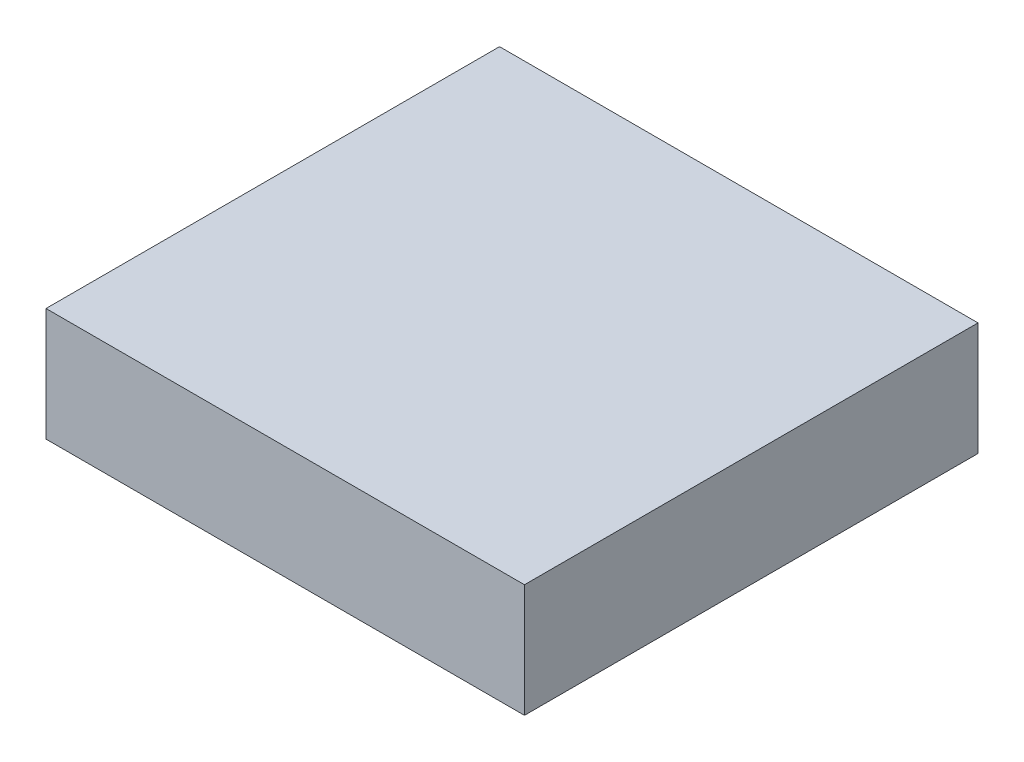
ISO-10303-21;
HEADER;
FILE_DESCRIPTION(('STEP AP214'),'2;1');
FILE_NAME('part.step','',(''),(''),'','','');
FILE_SCHEMA(('AUTOMOTIVE_DESIGN { 1 0 10303 214 1 1 1 1 }'));
ENDSEC;
DATA;
#1=APPLICATION_CONTEXT('core data for automotive mechanical design processes');
#2=APPLICATION_PROTOCOL_DEFINITION('international standard','automotive_design',2000,#1);
#3=PRODUCT_CONTEXT('',#1,'mechanical');
#4=PRODUCT('Part','Part','',(#3));
#5=PRODUCT_RELATED_PRODUCT_CATEGORY('part','',(#4));
#6=PRODUCT_DEFINITION_FORMATION('','',#4);
#7=PRODUCT_DEFINITION_CONTEXT('part definition',#1,'design');
#8=PRODUCT_DEFINITION('design','',#6,#7);
#9=PRODUCT_DEFINITION_SHAPE('','',#8);
#10=(LENGTH_UNIT() NAMED_UNIT(*) SI_UNIT(.MILLI.,.METRE.));
#11=(NAMED_UNIT(*) PLANE_ANGLE_UNIT() SI_UNIT($,.RADIAN.));
#12=(NAMED_UNIT(*) SI_UNIT($,.STERADIAN.) SOLID_ANGLE_UNIT());
#13=UNCERTAINTY_MEASURE_WITH_UNIT(LENGTH_MEASURE(1.E-05),#10,'distance_accuracy_value','');
#14=(GEOMETRIC_REPRESENTATION_CONTEXT(3) GLOBAL_UNCERTAINTY_ASSIGNED_CONTEXT((#13)) GLOBAL_UNIT_ASSIGNED_CONTEXT((#10,
#11,#12)) REPRESENTATION_CONTEXT('',''));
#15=CARTESIAN_POINT('',(0.,0.,0.));
#16=DIRECTION('',(0.,0.,1.));
#17=DIRECTION('',(1.,0.,0.));
#18=AXIS2_PLACEMENT_3D('',#15,#16,#17);
#19=CARTESIAN_POINT('',(-0.94949264,0.22449282,0.));
#20=DIRECTION('',(0.,1.,0.));
#21=DIRECTION('',(0.,0.,1.));
#22=AXIS2_PLACEMENT_3D('',#19,#20,#21);
#23=PLANE('',#22);
#24=DIRECTION('',(0.,0.,-1.));
#25=VECTOR('',#24,1.);
#26=CARTESIAN_POINT('',(0.94949264,0.22449282,0.));
#27=LINE('',#26,#25);
#28=CARTESIAN_POINT('',(0.94949264,0.22449282,0.));
#29=VERTEX_POINT('',#28);
#30=CARTESIAN_POINT('',(0.94949264,0.22449282,1.79999894));
#31=VERTEX_POINT('',#30);
#32=EDGE_CURVE('E20',#29,#31,#27,.F.);
#33=ORIENTED_EDGE('',*,*,#32,.F.);
#34=DIRECTION('',(-1.,0.,0.));
#35=VECTOR('',#34,1.);
#36=CARTESIAN_POINT('',(0.,0.22449282,0.));
#37=LINE('',#36,#35);
#38=CARTESIAN_POINT('',(-0.94949264,0.22449282,0.));
#39=VERTEX_POINT('',#38);
#40=EDGE_CURVE('E80',#39,#29,#37,.F.);
#41=ORIENTED_EDGE('',*,*,#40,.F.);
#42=DIRECTION('',(0.,0.,1.));
#43=VECTOR('',#42,1.);
#44=CARTESIAN_POINT('',(-0.94949264,0.22449282,0.));
#45=LINE('',#44,#43);
#46=CARTESIAN_POINT('',(-0.94949264,0.22449282,1.79999894));
#47=VERTEX_POINT('',#46);
#48=EDGE_CURVE('E61',#47,#39,#45,.F.);
#49=ORIENTED_EDGE('',*,*,#48,.F.);
#50=DIRECTION('',(-1.,0.,0.));
#51=VECTOR('',#50,1.);
#52=CARTESIAN_POINT('',(0.,0.22449282,1.79999894));
#53=LINE('',#52,#51);
#54=EDGE_CURVE('E55',#47,#31,#53,.F.);
#55=ORIENTED_EDGE('',*,*,#54,.T.);
#56=EDGE_LOOP('',(#33,#41,#49,#55));
#57=FACE_BOUND('',#56,.T.);
#58=ADVANCED_FACE('F17',(#57),#23,.T.);
#59=CARTESIAN_POINT('',(0.94949264,0.22449282,0.));
#60=DIRECTION('',(1.,0.,0.));
#61=DIRECTION('',(0.,0.,-1.));
#62=AXIS2_PLACEMENT_3D('',#59,#60,#61);
#63=PLANE('',#62);
#64=DIRECTION('',(0.,0.,-1.));
#65=VECTOR('',#64,1.);
#66=CARTESIAN_POINT('',(0.94949264,-0.22449028,0.));
#67=LINE('',#66,#65);
#68=CARTESIAN_POINT('',(0.94949264,-0.22449028,0.));
#69=VERTEX_POINT('',#68);
#70=CARTESIAN_POINT('',(0.94949264,-0.22449028,1.79999894));
#71=VERTEX_POINT('',#70);
#72=EDGE_CURVE('E83',#69,#71,#67,.F.);
#73=ORIENTED_EDGE('',*,*,#72,.F.);
#74=DIRECTION('',(0.,1.,0.));
#75=VECTOR('',#74,1.);
#76=CARTESIAN_POINT('',(0.94949264,1.269999998499E-06,0.));
#77=LINE('',#76,#75);
#78=EDGE_CURVE('E68',#29,#69,#77,.F.);
#79=ORIENTED_EDGE('',*,*,#78,.F.);
#80=ORIENTED_EDGE('',*,*,#32,.T.);
#81=DIRECTION('',(0.,1.,0.));
#82=VECTOR('',#81,1.);
#83=CARTESIAN_POINT('',(0.94949264,1.269999998499E-06,1.79999894));
#84=LINE('',#83,#82);
#85=EDGE_CURVE('E63',#31,#71,#84,.F.);
#86=ORIENTED_EDGE('',*,*,#85,.T.);
#87=EDGE_LOOP('',(#73,#79,#80,#86));
#88=FACE_BOUND('',#87,.T.);
#89=ADVANCED_FACE('F65',(#88),#63,.T.);
#90=CARTESIAN_POINT('',(0.,1.269999998499E-06,1.79999894));
#91=DIRECTION('',(0.,0.,-1.));
#92=DIRECTION('',(-1.,0.,0.));
#93=AXIS2_PLACEMENT_3D('',#90,#91,#92);
#94=PLANE('',#93);
#95=ORIENTED_EDGE('',*,*,#54,.F.);
#96=DIRECTION('',(0.,1.,0.));
#97=VECTOR('',#96,1.);
#98=CARTESIAN_POINT('',(-0.94949264,-0.22449028,1.79999894));
#99=LINE('',#98,#97);
#100=CARTESIAN_POINT('',(-0.94949264,-0.22449028,1.79999894));
#101=VERTEX_POINT('',#100);
#102=EDGE_CURVE('E74',#101,#47,#99,.T.);
#103=ORIENTED_EDGE('',*,*,#102,.F.);
#104=DIRECTION('',(1.,0.,0.));
#105=VECTOR('',#104,1.);
#106=CARTESIAN_POINT('',(0.94949264,-0.22449028,1.79999894));
#107=LINE('',#106,#105);
#108=EDGE_CURVE('E72',#71,#101,#107,.F.);
#109=ORIENTED_EDGE('',*,*,#108,.F.);
#110=ORIENTED_EDGE('',*,*,#85,.F.);
#111=EDGE_LOOP('',(#95,#103,#109,#110));
#112=FACE_BOUND('',#111,.T.);
#113=ADVANCED_FACE('F70',(#112),#94,.F.);
#114=CARTESIAN_POINT('',(-0.94949264,-0.22449028,0.));
#115=DIRECTION('',(-1.,0.,0.));
#116=DIRECTION('',(0.,0.,1.));
#117=AXIS2_PLACEMENT_3D('',#114,#115,#116);
#118=PLANE('',#117);
#119=ORIENTED_EDGE('',*,*,#48,.T.);
#120=DIRECTION('',(0.,1.,0.));
#121=VECTOR('',#120,1.);
#122=CARTESIAN_POINT('',(-0.94949264,1.269999998499E-06,0.));
#123=LINE('',#122,#121);
#124=CARTESIAN_POINT('',(-0.94949264,-0.22449028,0.));
#125=VERTEX_POINT('',#124);
#126=EDGE_CURVE('E35',#125,#39,#123,.T.);
#127=ORIENTED_EDGE('',*,*,#126,.F.);
#128=DIRECTION('',(0.,0.,-1.));
#129=VECTOR('',#128,1.);
#130=CARTESIAN_POINT('',(-0.94949264,-0.22449028,0.));
#131=LINE('',#130,#129);
#132=EDGE_CURVE('E26',#101,#125,#131,.T.);
#133=ORIENTED_EDGE('',*,*,#132,.F.);
#134=ORIENTED_EDGE('',*,*,#102,.T.);
#135=EDGE_LOOP('',(#119,#127,#133,#134));
#136=FACE_BOUND('',#135,.T.);
#137=ADVANCED_FACE('F89',(#136),#118,.T.);
#138=CARTESIAN_POINT('',(0.,1.269999998499E-06,0.));
#139=DIRECTION('',(0.,0.,-1.));
#140=DIRECTION('',(-1.,0.,0.));
#141=AXIS2_PLACEMENT_3D('',#138,#139,#140);
#142=PLANE('',#141);
#143=ORIENTED_EDGE('',*,*,#40,.T.);
#144=ORIENTED_EDGE('',*,*,#78,.T.);
#145=DIRECTION('',(1.,0.,0.));
#146=VECTOR('',#145,1.);
#147=CARTESIAN_POINT('',(0.94949264,-0.22449028,0.));
#148=LINE('',#147,#146);
#149=EDGE_CURVE('E11',#125,#69,#148,.T.);
#150=ORIENTED_EDGE('',*,*,#149,.F.);
#151=ORIENTED_EDGE('',*,*,#126,.T.);
#152=EDGE_LOOP('',(#143,#144,#150,#151));
#153=FACE_BOUND('',#152,.T.);
#154=ADVANCED_FACE('F91',(#153),#142,.T.);
#155=CARTESIAN_POINT('',(0.94949264,-0.22449028,0.));
#156=DIRECTION('',(0.,-1.,0.));
#157=DIRECTION('',(0.,0.,-1.));
#158=AXIS2_PLACEMENT_3D('',#155,#156,#157);
#159=PLANE('',#158);
#160=ORIENTED_EDGE('',*,*,#132,.T.);
#161=ORIENTED_EDGE('',*,*,#149,.T.);
#162=ORIENTED_EDGE('',*,*,#72,.T.);
#163=ORIENTED_EDGE('',*,*,#108,.T.);
#164=EDGE_LOOP('',(#160,#161,#162,#163));
#165=FACE_BOUND('',#164,.T.);
#166=ADVANCED_FACE('F88',(#165),#159,.T.);
#167=CLOSED_SHELL('',(#58,#89,#113,#137,#154,#166));
#168=MANIFOLD_SOLID_BREP('B1',#167);
#169=ADVANCED_BREP_SHAPE_REPRESENTATION('',(#18,#168),#14);
#170=SHAPE_DEFINITION_REPRESENTATION(#9,#169);
ENDSEC;
END-ISO-10303-21;
